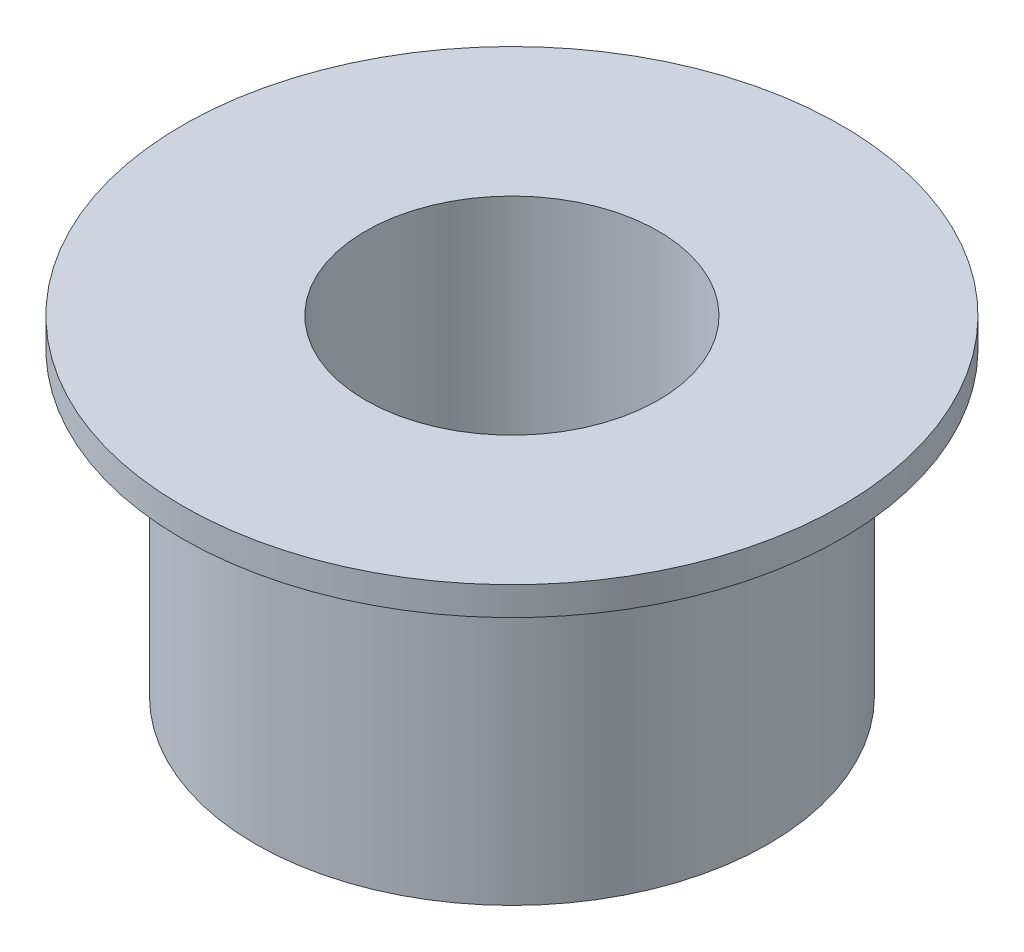
ISO-10303-21;
HEADER;
FILE_DESCRIPTION(('STEP AP214'),'2;1');
FILE_NAME('part.step','',(''),(''),'','','');
FILE_SCHEMA(('AUTOMOTIVE_DESIGN { 1 0 10303 214 1 1 1 1 }'));
ENDSEC;
DATA;
#1=APPLICATION_CONTEXT('core data for automotive mechanical design processes');
#2=APPLICATION_PROTOCOL_DEFINITION('international standard','automotive_design',2000,#1);
#3=PRODUCT_CONTEXT('',#1,'mechanical');
#4=PRODUCT('Part','Part','',(#3));
#5=PRODUCT_RELATED_PRODUCT_CATEGORY('part','',(#4));
#6=PRODUCT_DEFINITION_FORMATION('','',#4);
#7=PRODUCT_DEFINITION_CONTEXT('part definition',#1,'design');
#8=PRODUCT_DEFINITION('design','',#6,#7);
#9=PRODUCT_DEFINITION_SHAPE('','',#8);
#10=(LENGTH_UNIT() NAMED_UNIT(*) SI_UNIT(.MILLI.,.METRE.));
#11=(NAMED_UNIT(*) PLANE_ANGLE_UNIT() SI_UNIT($,.RADIAN.));
#12=(NAMED_UNIT(*) SI_UNIT($,.STERADIAN.) SOLID_ANGLE_UNIT());
#13=UNCERTAINTY_MEASURE_WITH_UNIT(LENGTH_MEASURE(1.E-05),#10,'distance_accuracy_value','');
#14=(GEOMETRIC_REPRESENTATION_CONTEXT(3) GLOBAL_UNCERTAINTY_ASSIGNED_CONTEXT((#13)) GLOBAL_UNIT_ASSIGNED_CONTEXT((#10,
#11,#12)) REPRESENTATION_CONTEXT('',''));
#15=CARTESIAN_POINT('',(0.,0.,0.));
#16=DIRECTION('',(0.,0.,1.));
#17=DIRECTION('',(1.,0.,0.));
#18=AXIS2_PLACEMENT_3D('',#15,#16,#17);
#19=CARTESIAN_POINT('',(0.,4.5,0.));
#20=DIRECTION('',(0.,1.,0.));
#21=DIRECTION('',(0.,0.,1.));
#22=AXIS2_PLACEMENT_3D('',#19,#20,#21);
#23=CYLINDRICAL_SURFACE('',#22,7.);
#24=CARTESIAN_POINT('',(0.,3.721715758996,0.));
#25=DIRECTION('',(0.,1.,0.));
#26=DIRECTION('',(0.,0.,1.));
#27=AXIS2_PLACEMENT_3D('',#24,#25,#26);
#28=CIRCLE('',#27,7.);
#29=CARTESIAN_POINT('',(0.,3.721715758996,7.));
#30=VERTEX_POINT('',#29);
#31=EDGE_CURVE('E10',#30,#30,#28,.T.);
#32=ORIENTED_EDGE('',*,*,#31,.F.);
#33=EDGE_LOOP('',(#32));
#34=FACE_BOUND('',#33,.T.);
#35=CARTESIAN_POINT('',(0.,-4.49999999999999,0.));
#36=DIRECTION('',(0.,1.,0.));
#37=DIRECTION('',(0.,0.,1.));
#38=AXIS2_PLACEMENT_3D('',#35,#36,#37);
#39=CIRCLE('',#38,7.);
#40=CARTESIAN_POINT('',(0.,-4.49999999999999,7.));
#41=VERTEX_POINT('',#40);
#42=EDGE_CURVE('E74',#41,#41,#39,.T.);
#43=ORIENTED_EDGE('',*,*,#42,.T.);
#44=EDGE_LOOP('',(#43));
#45=FACE_BOUND('',#44,.T.);
#46=ADVANCED_FACE('F47',(#34,#45),#23,.T.);
#47=CARTESIAN_POINT('',(0.,3.721715758996,-9.));
#48=DIRECTION('',(0.,1.,0.));
#49=DIRECTION('',(0.,0.,1.));
#50=AXIS2_PLACEMENT_3D('',#47,#48,#49);
#51=PLANE('',#50);
#52=CARTESIAN_POINT('',(0.,3.721715758996,0.));
#53=DIRECTION('',(0.,1.,0.));
#54=DIRECTION('',(0.,0.,1.));
#55=AXIS2_PLACEMENT_3D('',#52,#53,#54);
#56=CIRCLE('',#55,9.);
#57=CARTESIAN_POINT('',(0.,3.721715758996,9.));
#58=VERTEX_POINT('',#57);
#59=EDGE_CURVE('E54',#58,#58,#56,.T.);
#60=ORIENTED_EDGE('',*,*,#59,.F.);
#61=EDGE_LOOP('',(#60));
#62=FACE_BOUND('',#61,.T.);
#63=ORIENTED_EDGE('',*,*,#31,.T.);
#64=EDGE_LOOP('',(#63));
#65=FACE_BOUND('',#64,.T.);
#66=ADVANCED_FACE('F100',(#62,#65),#51,.F.);
#67=CARTESIAN_POINT('',(0.,4.5,0.));
#68=DIRECTION('',(0.,1.,0.));
#69=DIRECTION('',(0.,0.,1.));
#70=AXIS2_PLACEMENT_3D('',#67,#68,#69);
#71=CYLINDRICAL_SURFACE('',#70,9.);
#72=CARTESIAN_POINT('',(0.,4.5,0.));
#73=DIRECTION('',(0.,1.,0.));
#74=DIRECTION('',(0.,0.,1.));
#75=AXIS2_PLACEMENT_3D('',#72,#73,#74);
#76=CIRCLE('',#75,9.);
#77=CARTESIAN_POINT('',(0.,4.5,9.));
#78=VERTEX_POINT('',#77);
#79=EDGE_CURVE('E59',#78,#78,#76,.T.);
#80=ORIENTED_EDGE('',*,*,#79,.F.);
#81=EDGE_LOOP('',(#80));
#82=FACE_BOUND('',#81,.T.);
#83=ORIENTED_EDGE('',*,*,#59,.T.);
#84=EDGE_LOOP('',(#83));
#85=FACE_BOUND('',#84,.T.);
#86=ADVANCED_FACE('F95',(#82,#85),#71,.T.);
#87=CARTESIAN_POINT('',(0.,4.5,-4.));
#88=DIRECTION('',(0.,-1.,0.));
#89=DIRECTION('',(0.,0.,-1.));
#90=AXIS2_PLACEMENT_3D('',#87,#88,#89);
#91=PLANE('',#90);
#92=CARTESIAN_POINT('',(0.,4.5,0.));
#93=DIRECTION('',(0.,1.,0.));
#94=DIRECTION('',(0.,0.,1.));
#95=AXIS2_PLACEMENT_3D('',#92,#93,#94);
#96=CIRCLE('',#95,4.);
#97=CARTESIAN_POINT('',(0.,4.5,4.));
#98=VERTEX_POINT('',#97);
#99=EDGE_CURVE('E64',#98,#98,#96,.T.);
#100=ORIENTED_EDGE('',*,*,#99,.F.);
#101=EDGE_LOOP('',(#100));
#102=FACE_BOUND('',#101,.T.);
#103=ORIENTED_EDGE('',*,*,#79,.T.);
#104=EDGE_LOOP('',(#103));
#105=FACE_BOUND('',#104,.T.);
#106=ADVANCED_FACE('F89',(#102,#105),#91,.F.);
#107=CARTESIAN_POINT('',(0.,4.5,0.));
#108=DIRECTION('',(0.,1.,0.));
#109=DIRECTION('',(0.,0.,1.));
#110=AXIS2_PLACEMENT_3D('',#107,#108,#109);
#111=CYLINDRICAL_SURFACE('',#110,4.);
#112=CARTESIAN_POINT('',(0.,-2.49999999999999,0.));
#113=DIRECTION('',(0.,1.,0.));
#114=DIRECTION('',(0.,0.,1.));
#115=AXIS2_PLACEMENT_3D('',#112,#113,#114);
#116=CIRCLE('',#115,4.);
#117=CARTESIAN_POINT('',(0.,-2.49999999999999,4.));
#118=VERTEX_POINT('',#117);
#119=EDGE_CURVE('E70',#118,#118,#116,.T.);
#120=ORIENTED_EDGE('',*,*,#119,.F.);
#121=EDGE_LOOP('',(#120));
#122=FACE_BOUND('',#121,.T.);
#123=ORIENTED_EDGE('',*,*,#99,.T.);
#124=EDGE_LOOP('',(#123));
#125=FACE_BOUND('',#124,.T.);
#126=ADVANCED_FACE('F83',(#122,#125),#111,.F.);
#127=CARTESIAN_POINT('',(0.,-2.49999999999999,0.));
#128=DIRECTION('',(0.,-1.,0.));
#129=DIRECTION('',(0.,0.,-1.));
#130=AXIS2_PLACEMENT_3D('',#127,#128,#129);
#131=CONICAL_SURFACE('',#130,4.,0.982793723247329);
#132=ORIENTED_EDGE('',*,*,#42,.F.);
#133=EDGE_LOOP('',(#132));
#134=FACE_BOUND('',#133,.T.);
#135=ORIENTED_EDGE('',*,*,#119,.T.);
#136=EDGE_LOOP('',(#135));
#137=FACE_BOUND('',#136,.T.);
#138=ADVANCED_FACE('F80',(#134,#137),#131,.F.);
#139=CLOSED_SHELL('',(#46,#66,#86,#106,#126,#138));
#140=MANIFOLD_SOLID_BREP('B2',#139);
#141=ADVANCED_BREP_SHAPE_REPRESENTATION('',(#18,#140),#14);
#142=SHAPE_DEFINITION_REPRESENTATION(#9,#141);
ENDSEC;
END-ISO-10303-21;
